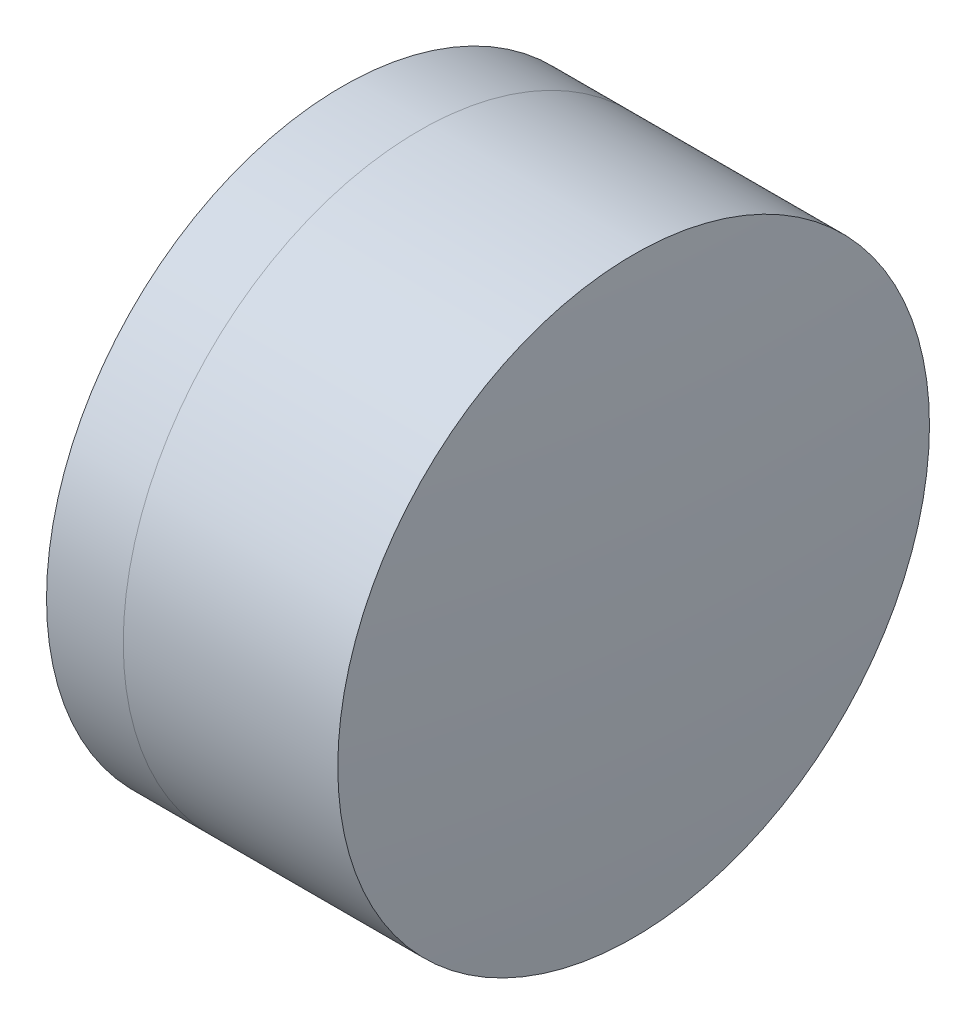
ISO-10303-21;
HEADER;
FILE_DESCRIPTION(('STEP AP214'),'2;1');
FILE_NAME('part.step','',(''),(''),'','','');
FILE_SCHEMA(('AUTOMOTIVE_DESIGN { 1 0 10303 214 1 1 1 1 }'));
ENDSEC;
DATA;
#1=APPLICATION_CONTEXT('core data for automotive mechanical design processes');
#2=APPLICATION_PROTOCOL_DEFINITION('international standard','automotive_design',2000,#1);
#3=PRODUCT_CONTEXT('',#1,'mechanical');
#4=PRODUCT('Part','Part','',(#3));
#5=PRODUCT_RELATED_PRODUCT_CATEGORY('part','',(#4));
#6=PRODUCT_DEFINITION_FORMATION('','',#4);
#7=PRODUCT_DEFINITION_CONTEXT('part definition',#1,'design');
#8=PRODUCT_DEFINITION('design','',#6,#7);
#9=PRODUCT_DEFINITION_SHAPE('','',#8);
#10=(LENGTH_UNIT() NAMED_UNIT(*) SI_UNIT(.MILLI.,.METRE.));
#11=(NAMED_UNIT(*) PLANE_ANGLE_UNIT() SI_UNIT($,.RADIAN.));
#12=(NAMED_UNIT(*) SI_UNIT($,.STERADIAN.) SOLID_ANGLE_UNIT());
#13=UNCERTAINTY_MEASURE_WITH_UNIT(LENGTH_MEASURE(1.E-05),#10,'distance_accuracy_value','');
#14=(GEOMETRIC_REPRESENTATION_CONTEXT(3) GLOBAL_UNCERTAINTY_ASSIGNED_CONTEXT((#13)) GLOBAL_UNIT_ASSIGNED_CONTEXT((#10,
#11,#12)) REPRESENTATION_CONTEXT('',''));
#15=CARTESIAN_POINT('',(0.,0.,0.));
#16=DIRECTION('',(0.,0.,1.));
#17=DIRECTION('',(1.,0.,0.));
#18=AXIS2_PLACEMENT_3D('',#15,#16,#17);
#19=CARTESIAN_POINT('',(-5.05256057380979,0.,0.));
#20=DIRECTION('',(-1.,0.,0.));
#21=DIRECTION('',(0.,0.,1.));
#22=AXIS2_PLACEMENT_3D('',#19,#20,#21);
#23=SPHERICAL_SURFACE('',#22,5.9);
#24=CARTESIAN_POINT('',(-0.0796967108028833,0.,0.));
#25=DIRECTION('',(-1.,0.,0.));
#26=DIRECTION('',(0.,0.,1.));
#27=AXIS2_PLACEMENT_3D('',#24,#25,#26);
#28=CIRCLE('',#27,3.175);
#29=CARTESIAN_POINT('',(-0.0796967108028833,0.,3.175));
#30=VERTEX_POINT('',#29);
#31=EDGE_CURVE('E11',#30,#30,#28,.T.);
#32=ORIENTED_EDGE('',*,*,#31,.T.);
#33=EDGE_LOOP('',(#32));
#34=FACE_BOUND('',#33,.T.);
#35=ADVANCED_FACE('F47',(#34),#23,.F.);
#36=CARTESIAN_POINT('',(-0.551919992657797,0.,0.));
#37=DIRECTION('',(-1.,0.,0.));
#38=DIRECTION('',(0.,0.,1.));
#39=AXIS2_PLACEMENT_3D('',#36,#37,#38);
#40=CYLINDRICAL_SURFACE('',#39,3.175);
#41=CARTESIAN_POINT('',(2.22248598109812,0.,0.));
#42=DIRECTION('',(-1.,0.,0.));
#43=DIRECTION('',(0.,0.,1.));
#44=AXIS2_PLACEMENT_3D('',#41,#42,#43);
#45=CIRCLE('',#44,3.175);
#46=CARTESIAN_POINT('',(2.22248598109812,0.,3.175));
#47=VERTEX_POINT('',#46);
#48=EDGE_CURVE('E53',#47,#47,#45,.T.);
#49=ORIENTED_EDGE('',*,*,#48,.T.);
#50=EDGE_LOOP('',(#49));
#51=FACE_BOUND('',#50,.T.);
#52=ORIENTED_EDGE('',*,*,#31,.F.);
#53=EDGE_LOOP('',(#52));
#54=FACE_BOUND('',#53,.T.);
#55=ADVANCED_FACE('F59',(#51,#54),#40,.T.);
#56=CARTESIAN_POINT('',(-38.0525605738098,0.,0.));
#57=DIRECTION('',(-1.,0.,0.));
#58=DIRECTION('',(0.,0.,1.));
#59=AXIS2_PLACEMENT_3D('',#56,#57,#58);
#60=SPHERICAL_SURFACE('',#59,40.4);
#61=ORIENTED_EDGE('',*,*,#48,.F.);
#62=EDGE_LOOP('',(#61));
#63=FACE_BOUND('',#62,.T.);
#64=ADVANCED_FACE('F62',(#63),#60,.T.);
#65=CLOSED_SHELL('',(#35,#55,#64));
#66=MANIFOLD_SOLID_BREP('B2',#65);
#67=CARTESIAN_POINT('',(5.44743942619021,0.,0.));
#68=DIRECTION('',(-1.,0.,0.));
#69=DIRECTION('',(0.,0.,1.));
#70=AXIS2_PLACEMENT_3D('',#67,#68,#69);
#71=SPHERICAL_SURFACE('',#70,7.1);
#72=CARTESIAN_POINT('',(-0.903101889319833,0.,0.));
#73=DIRECTION('',(-1.,0.,0.));
#74=DIRECTION('',(0.,0.,1.));
#75=AXIS2_PLACEMENT_3D('',#72,#73,#74);
#76=CIRCLE('',#75,3.175);
#77=CARTESIAN_POINT('',(-0.903101889319833,0.,3.175));
#78=VERTEX_POINT('',#77);
#79=EDGE_CURVE('E46',#78,#78,#76,.T.);
#80=ORIENTED_EDGE('',*,*,#79,.T.);
#81=EDGE_LOOP('',(#80));
#82=FACE_BOUND('',#81,.T.);
#83=ADVANCED_FACE('F88',(#82),#71,.T.);
#84=CARTESIAN_POINT('',(-9.70261217833668,0.,0.));
#85=DIRECTION('',(-1.,0.,0.));
#86=DIRECTION('',(0.,0.,1.));
#87=AXIS2_PLACEMENT_3D('',#84,#85,#86);
#88=CYLINDRICAL_SURFACE('',#87,3.175);
#89=CARTESIAN_POINT('',(-0.0796967108028825,0.,0.));
#90=DIRECTION('',(-1.,0.,0.));
#91=DIRECTION('',(0.,0.,1.));
#92=AXIS2_PLACEMENT_3D('',#89,#90,#91);
#93=CIRCLE('',#92,3.175);
#94=CARTESIAN_POINT('',(-0.0796967108028825,0.,3.175));
#95=VERTEX_POINT('',#94);
#96=EDGE_CURVE('E94',#95,#95,#93,.T.);
#97=ORIENTED_EDGE('',*,*,#96,.T.);
#98=EDGE_LOOP('',(#97));
#99=FACE_BOUND('',#98,.T.);
#100=ORIENTED_EDGE('',*,*,#79,.F.);
#101=EDGE_LOOP('',(#100));
#102=FACE_BOUND('',#101,.T.);
#103=ADVANCED_FACE('F100',(#99,#102),#88,.T.);
#104=CARTESIAN_POINT('',(-5.05256057380979,0.,0.));
#105=DIRECTION('',(-1.,0.,0.));
#106=DIRECTION('',(0.,0.,1.));
#107=AXIS2_PLACEMENT_3D('',#104,#105,#106);
#108=SPHERICAL_SURFACE('',#107,5.9);
#109=ORIENTED_EDGE('',*,*,#96,.F.);
#110=EDGE_LOOP('',(#109));
#111=FACE_BOUND('',#110,.T.);
#112=ADVANCED_FACE('F103',(#111),#108,.T.);
#113=CLOSED_SHELL('',(#83,#103,#112));
#114=MANIFOLD_SOLID_BREP('B6',#113);
#115=ADVANCED_BREP_SHAPE_REPRESENTATION('',(#18,#66,#114),#14);
#116=SHAPE_DEFINITION_REPRESENTATION(#9,#115);
ENDSEC;
END-ISO-10303-21;
